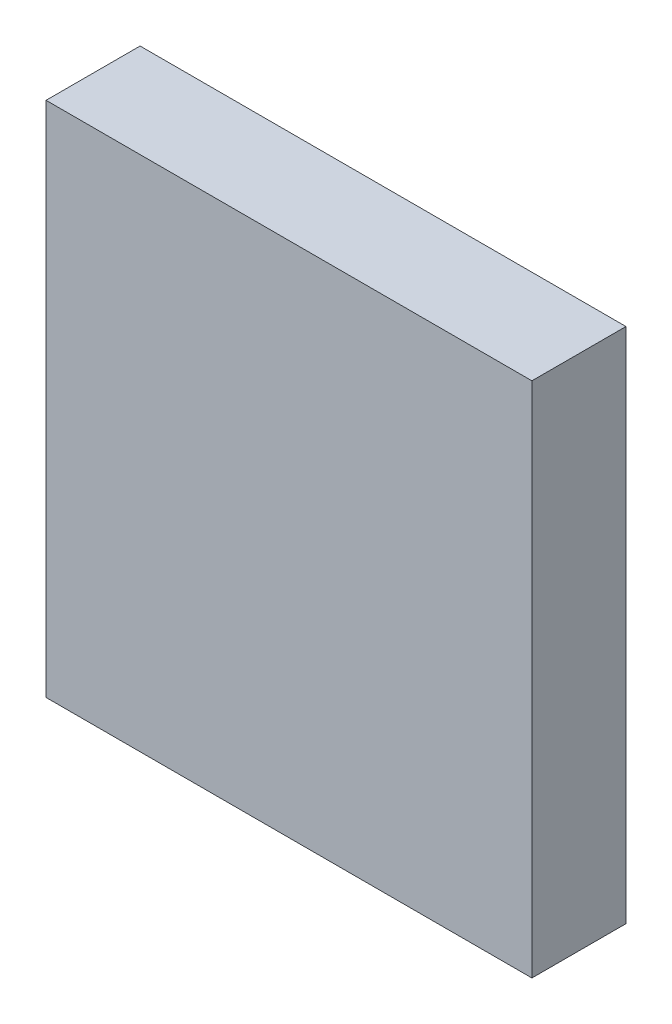
ISO-10303-21;
HEADER;
FILE_DESCRIPTION(('STEP AP214'),'2;1');
FILE_NAME('part.step','',(''),(''),'','','');
FILE_SCHEMA(('AUTOMOTIVE_DESIGN { 1 0 10303 214 1 1 1 1 }'));
ENDSEC;
DATA;
#1=APPLICATION_CONTEXT('core data for automotive mechanical design processes');
#2=APPLICATION_PROTOCOL_DEFINITION('international standard','automotive_design',2000,#1);
#3=PRODUCT_CONTEXT('',#1,'mechanical');
#4=PRODUCT('Part','Part','',(#3));
#5=PRODUCT_RELATED_PRODUCT_CATEGORY('part','',(#4));
#6=PRODUCT_DEFINITION_FORMATION('','',#4);
#7=PRODUCT_DEFINITION_CONTEXT('part definition',#1,'design');
#8=PRODUCT_DEFINITION('design','',#6,#7);
#9=PRODUCT_DEFINITION_SHAPE('','',#8);
#10=(LENGTH_UNIT() NAMED_UNIT(*) SI_UNIT(.MILLI.,.METRE.));
#11=(NAMED_UNIT(*) PLANE_ANGLE_UNIT() SI_UNIT($,.RADIAN.));
#12=(NAMED_UNIT(*) SI_UNIT($,.STERADIAN.) SOLID_ANGLE_UNIT());
#13=UNCERTAINTY_MEASURE_WITH_UNIT(LENGTH_MEASURE(1.E-05),#10,'distance_accuracy_value','');
#14=(GEOMETRIC_REPRESENTATION_CONTEXT(3) GLOBAL_UNCERTAINTY_ASSIGNED_CONTEXT((#13)) GLOBAL_UNIT_ASSIGNED_CONTEXT((#10,
#11,#12)) REPRESENTATION_CONTEXT('',''));
#15=CARTESIAN_POINT('',(0.,0.,0.));
#16=DIRECTION('',(0.,0.,1.));
#17=DIRECTION('',(1.,0.,0.));
#18=AXIS2_PLACEMENT_3D('',#15,#16,#17);
#19=CARTESIAN_POINT('',(-1.54999944,1.64999924,0.));
#20=DIRECTION('',(0.,0.,1.));
#21=DIRECTION('',(1.,0.,0.));
#22=AXIS2_PLACEMENT_3D('',#19,#20,#21);
#23=PLANE('',#22);
#24=DIRECTION('',(0.,1.,0.));
#25=VECTOR('',#24,1.);
#26=CARTESIAN_POINT('',(1.54999944,1.64999924,0.));
#27=LINE('',#26,#25);
#28=CARTESIAN_POINT('',(1.54999944,-1.64999924,0.));
#29=VERTEX_POINT('',#28);
#30=CARTESIAN_POINT('',(1.54999944,1.64999924,0.));
#31=VERTEX_POINT('',#30);
#32=EDGE_CURVE('E69',#29,#31,#27,.T.);
#33=ORIENTED_EDGE('',*,*,#32,.F.);
#34=DIRECTION('',(1.,0.,0.));
#35=VECTOR('',#34,1.);
#36=CARTESIAN_POINT('',(1.54999944,-1.64999924,0.));
#37=LINE('',#36,#35);
#38=CARTESIAN_POINT('',(-1.54999944,-1.64999924,0.));
#39=VERTEX_POINT('',#38);
#40=EDGE_CURVE('E56',#39,#29,#37,.T.);
#41=ORIENTED_EDGE('',*,*,#40,.F.);
#42=DIRECTION('',(0.,1.,0.));
#43=VECTOR('',#42,1.);
#44=CARTESIAN_POINT('',(-1.54999944,-1.64999924,0.));
#45=LINE('',#44,#43);
#46=CARTESIAN_POINT('',(-1.54999944,1.64999924,0.));
#47=VERTEX_POINT('',#46);
#48=EDGE_CURVE('E21',#47,#39,#45,.F.);
#49=ORIENTED_EDGE('',*,*,#48,.F.);
#50=DIRECTION('',(1.,0.,0.));
#51=VECTOR('',#50,1.);
#52=CARTESIAN_POINT('',(-1.54999944,1.64999924,0.));
#53=LINE('',#52,#51);
#54=EDGE_CURVE('E82',#31,#47,#53,.F.);
#55=ORIENTED_EDGE('',*,*,#54,.F.);
#56=EDGE_LOOP('',(#33,#41,#49,#55));
#57=FACE_BOUND('',#56,.T.);
#58=ADVANCED_FACE('F18',(#57),#23,.F.);
#59=CARTESIAN_POINT('',(-1.54999944,-1.64999924,0.));
#60=DIRECTION('',(-1.,0.,0.));
#61=DIRECTION('',(0.,0.,1.));
#62=AXIS2_PLACEMENT_3D('',#59,#60,#61);
#63=PLANE('',#62);
#64=DIRECTION('',(0.,0.,1.));
#65=VECTOR('',#64,1.);
#66=CARTESIAN_POINT('',(-1.54999944,1.64999924,0.));
#67=LINE('',#66,#65);
#68=CARTESIAN_POINT('',(-1.54999944,1.64999924,0.5999988));
#69=VERTEX_POINT('',#68);
#70=EDGE_CURVE('E65',#47,#69,#67,.T.);
#71=ORIENTED_EDGE('',*,*,#70,.F.);
#72=ORIENTED_EDGE('',*,*,#48,.T.);
#73=DIRECTION('',(0.,0.,-1.));
#74=VECTOR('',#73,1.);
#75=CARTESIAN_POINT('',(-1.54999944,-1.64999924,0.));
#76=LINE('',#75,#74);
#77=CARTESIAN_POINT('',(-1.54999944,-1.64999924,0.5999988));
#78=VERTEX_POINT('',#77);
#79=EDGE_CURVE('E62',#78,#39,#76,.T.);
#80=ORIENTED_EDGE('',*,*,#79,.F.);
#81=DIRECTION('',(0.,1.,0.));
#82=VECTOR('',#81,1.);
#83=CARTESIAN_POINT('',(-1.54999944,1.64999924,0.5999988));
#84=LINE('',#83,#82);
#85=EDGE_CURVE('E84',#69,#78,#84,.F.);
#86=ORIENTED_EDGE('',*,*,#85,.F.);
#87=EDGE_LOOP('',(#71,#72,#80,#86));
#88=FACE_BOUND('',#87,.T.);
#89=ADVANCED_FACE('F61',(#88),#63,.T.);
#90=CARTESIAN_POINT('',(1.54999944,-1.64999924,0.));
#91=DIRECTION('',(0.,-1.,0.));
#92=DIRECTION('',(0.,0.,-1.));
#93=AXIS2_PLACEMENT_3D('',#90,#91,#92);
#94=PLANE('',#93);
#95=ORIENTED_EDGE('',*,*,#79,.T.);
#96=ORIENTED_EDGE('',*,*,#40,.T.);
#97=DIRECTION('',(0.,0.,-1.));
#98=VECTOR('',#97,1.);
#99=CARTESIAN_POINT('',(1.54999944,-1.64999924,0.));
#100=LINE('',#99,#98);
#101=CARTESIAN_POINT('',(1.54999944,-1.64999924,0.5999988));
#102=VERTEX_POINT('',#101);
#103=EDGE_CURVE('E71',#102,#29,#100,.T.);
#104=ORIENTED_EDGE('',*,*,#103,.F.);
#105=DIRECTION('',(1.,0.,0.));
#106=VECTOR('',#105,1.);
#107=CARTESIAN_POINT('',(-1.54999944,-1.64999924,0.5999988));
#108=LINE('',#107,#106);
#109=EDGE_CURVE('E75',#78,#102,#108,.T.);
#110=ORIENTED_EDGE('',*,*,#109,.F.);
#111=EDGE_LOOP('',(#95,#96,#104,#110));
#112=FACE_BOUND('',#111,.T.);
#113=ADVANCED_FACE('F73',(#112),#94,.T.);
#114=CARTESIAN_POINT('',(1.54999944,1.64999924,0.));
#115=DIRECTION('',(1.,0.,0.));
#116=DIRECTION('',(0.,0.,-1.));
#117=AXIS2_PLACEMENT_3D('',#114,#115,#116);
#118=PLANE('',#117);
#119=ORIENTED_EDGE('',*,*,#103,.T.);
#120=ORIENTED_EDGE('',*,*,#32,.T.);
#121=DIRECTION('',(0.,0.,1.));
#122=VECTOR('',#121,1.);
#123=CARTESIAN_POINT('',(1.54999944,1.64999924,0.));
#124=LINE('',#123,#122);
#125=CARTESIAN_POINT('',(1.54999944,1.64999924,0.5999988));
#126=VERTEX_POINT('',#125);
#127=EDGE_CURVE('E36',#126,#31,#124,.F.);
#128=ORIENTED_EDGE('',*,*,#127,.F.);
#129=DIRECTION('',(0.,1.,0.));
#130=VECTOR('',#129,1.);
#131=CARTESIAN_POINT('',(1.54999944,1.64999924,0.5999988));
#132=LINE('',#131,#130);
#133=EDGE_CURVE('E27',#102,#126,#132,.T.);
#134=ORIENTED_EDGE('',*,*,#133,.F.);
#135=EDGE_LOOP('',(#119,#120,#128,#134));
#136=FACE_BOUND('',#135,.T.);
#137=ADVANCED_FACE('F90',(#136),#118,.T.);
#138=CARTESIAN_POINT('',(-1.54999944,1.64999924,0.));
#139=DIRECTION('',(0.,1.,0.));
#140=DIRECTION('',(0.,0.,1.));
#141=AXIS2_PLACEMENT_3D('',#138,#139,#140);
#142=PLANE('',#141);
#143=ORIENTED_EDGE('',*,*,#127,.T.);
#144=ORIENTED_EDGE('',*,*,#54,.T.);
#145=ORIENTED_EDGE('',*,*,#70,.T.);
#146=DIRECTION('',(1.,0.,0.));
#147=VECTOR('',#146,1.);
#148=CARTESIAN_POINT('',(-1.54999944,1.64999924,0.5999988));
#149=LINE('',#148,#147);
#150=EDGE_CURVE('E11',#126,#69,#149,.F.);
#151=ORIENTED_EDGE('',*,*,#150,.F.);
#152=EDGE_LOOP('',(#143,#144,#145,#151));
#153=FACE_BOUND('',#152,.T.);
#154=ADVANCED_FACE('F92',(#153),#142,.T.);
#155=CARTESIAN_POINT('',(-1.54999944,1.64999924,0.5999988));
#156=DIRECTION('',(0.,0.,1.));
#157=DIRECTION('',(1.,0.,0.));
#158=AXIS2_PLACEMENT_3D('',#155,#156,#157);
#159=PLANE('',#158);
#160=ORIENTED_EDGE('',*,*,#133,.T.);
#161=ORIENTED_EDGE('',*,*,#150,.T.);
#162=ORIENTED_EDGE('',*,*,#85,.T.);
#163=ORIENTED_EDGE('',*,*,#109,.T.);
#164=EDGE_LOOP('',(#160,#161,#162,#163));
#165=FACE_BOUND('',#164,.T.);
#166=ADVANCED_FACE('F89',(#165),#159,.T.);
#167=CLOSED_SHELL('',(#58,#89,#113,#137,#154,#166));
#168=MANIFOLD_SOLID_BREP('B1',#167);
#169=ADVANCED_BREP_SHAPE_REPRESENTATION('',(#18,#168),#14);
#170=SHAPE_DEFINITION_REPRESENTATION(#9,#169);
ENDSEC;
END-ISO-10303-21;
